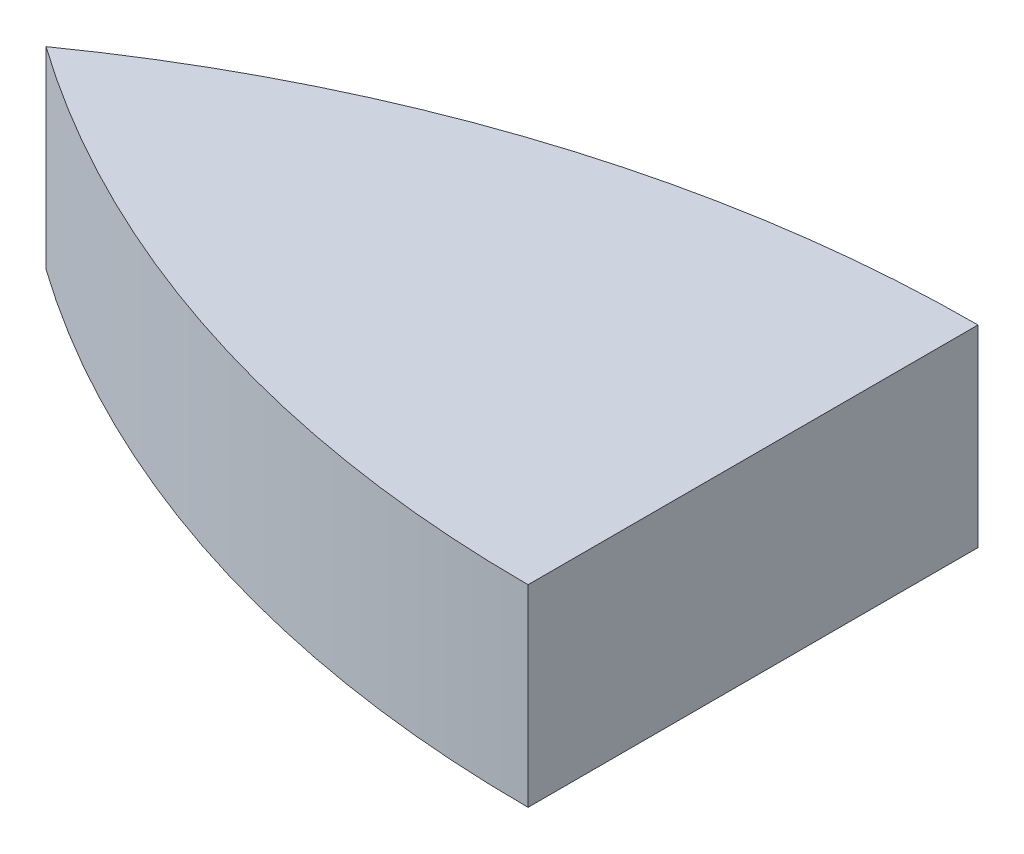
ISO-10303-21;
HEADER;
FILE_DESCRIPTION(('STEP AP214'),'2;1');
FILE_NAME('part.step','',(''),(''),'','','');
FILE_SCHEMA(('AUTOMOTIVE_DESIGN { 1 0 10303 214 1 1 1 1 }'));
ENDSEC;
DATA;
#1=APPLICATION_CONTEXT('core data for automotive mechanical design processes');
#2=APPLICATION_PROTOCOL_DEFINITION('international standard','automotive_design',2000,#1);
#3=PRODUCT_CONTEXT('',#1,'mechanical');
#4=PRODUCT('Part','Part','',(#3));
#5=PRODUCT_RELATED_PRODUCT_CATEGORY('part','',(#4));
#6=PRODUCT_DEFINITION_FORMATION('','',#4);
#7=PRODUCT_DEFINITION_CONTEXT('part definition',#1,'design');
#8=PRODUCT_DEFINITION('design','',#6,#7);
#9=PRODUCT_DEFINITION_SHAPE('','',#8);
#10=(LENGTH_UNIT() NAMED_UNIT(*) SI_UNIT(.MILLI.,.METRE.));
#11=(NAMED_UNIT(*) PLANE_ANGLE_UNIT() SI_UNIT($,.RADIAN.));
#12=(NAMED_UNIT(*) SI_UNIT($,.STERADIAN.) SOLID_ANGLE_UNIT());
#13=UNCERTAINTY_MEASURE_WITH_UNIT(LENGTH_MEASURE(1.E-05),#10,'distance_accuracy_value','');
#14=(GEOMETRIC_REPRESENTATION_CONTEXT(3) GLOBAL_UNCERTAINTY_ASSIGNED_CONTEXT((#13)) GLOBAL_UNIT_ASSIGNED_CONTEXT((#10,
#11,#12)) REPRESENTATION_CONTEXT('',''));
#15=CARTESIAN_POINT('',(0.,0.,0.));
#16=DIRECTION('',(0.,0.,1.));
#17=DIRECTION('',(1.,0.,0.));
#18=AXIS2_PLACEMENT_3D('',#15,#16,#17);
#19=CARTESIAN_POINT('',(13.2614708861326,1.5,7.76785714285714));
#20=DIRECTION('',(0.,-1.,0.));
#21=DIRECTION('',(0.,0.,-1.));
#22=AXIS2_PLACEMENT_3D('',#19,#20,#21);
#23=CYLINDRICAL_SURFACE('',#22,9.51785714285714);
#24=CARTESIAN_POINT('',(13.2614708861326,0.,7.76785714285714));
#25=DIRECTION('',(0.,1.,0.));
#26=DIRECTION('',(0.,0.,1.));
#27=AXIS2_PLACEMENT_3D('',#24,#25,#26);
#28=CIRCLE('',#27,9.51785714285714);
#29=CARTESIAN_POINT('',(13.2614708861326,0.,-1.75));
#30=VERTEX_POINT('',#29);
#31=CARTESIAN_POINT('',(7.76147088613261,0.,0.));
#32=VERTEX_POINT('',#31);
#33=EDGE_CURVE('E93',#30,#32,#28,.T.);
#34=ORIENTED_EDGE('',*,*,#33,.T.);
#35=DIRECTION('',(0.,-1.,0.));
#36=VECTOR('',#35,1.);
#37=CARTESIAN_POINT('',(7.76147088613261,1.5,0.));
#38=LINE('',#37,#36);
#39=CARTESIAN_POINT('',(7.76147088613261,1.5,0.));
#40=VERTEX_POINT('',#39);
#41=EDGE_CURVE('E11',#40,#32,#38,.T.);
#42=ORIENTED_EDGE('',*,*,#41,.F.);
#43=CARTESIAN_POINT('',(13.2614708861326,1.5,7.76785714285714));
#44=DIRECTION('',(0.,1.,0.));
#45=DIRECTION('',(0.,0.,1.));
#46=AXIS2_PLACEMENT_3D('',#43,#44,#45);
#47=CIRCLE('',#46,9.51785714285714);
#48=CARTESIAN_POINT('',(13.2614708861326,1.5,-1.75));
#49=VERTEX_POINT('',#48);
#50=EDGE_CURVE('E85',#49,#40,#47,.T.);
#51=ORIENTED_EDGE('',*,*,#50,.F.);
#52=DIRECTION('',(0.,-1.,0.));
#53=VECTOR('',#52,1.);
#54=CARTESIAN_POINT('',(13.2614708861326,1.5,-1.75));
#55=LINE('',#54,#53);
#56=EDGE_CURVE('E94',#49,#30,#55,.T.);
#57=ORIENTED_EDGE('',*,*,#56,.T.);
#58=EDGE_LOOP('',(#34,#42,#51,#57));
#59=FACE_BOUND('',#58,.T.);
#60=ADVANCED_FACE('F43',(#59),#23,.T.);
#61=CARTESIAN_POINT('',(13.2614708861326,1.5,-7.76785714285714));
#62=DIRECTION('',(0.,-1.,0.));
#63=DIRECTION('',(0.,0.,-1.));
#64=AXIS2_PLACEMENT_3D('',#61,#62,#63);
#65=CYLINDRICAL_SURFACE('',#64,9.51785714285714);
#66=CARTESIAN_POINT('',(13.2614708861326,0.,-7.76785714285714));
#67=DIRECTION('',(0.,1.,0.));
#68=DIRECTION('',(0.,0.,-1.));
#69=AXIS2_PLACEMENT_3D('',#66,#67,#68);
#70=CIRCLE('',#69,9.51785714285714);
#71=CARTESIAN_POINT('',(13.2614708861326,0.,1.75));
#72=VERTEX_POINT('',#71);
#73=EDGE_CURVE('E72',#32,#72,#70,.T.);
#74=ORIENTED_EDGE('',*,*,#73,.T.);
#75=DIRECTION('',(0.,-1.,0.));
#76=VECTOR('',#75,1.);
#77=CARTESIAN_POINT('',(13.2614708861326,1.5,1.75));
#78=LINE('',#77,#76);
#79=CARTESIAN_POINT('',(13.2614708861326,1.5,1.75));
#80=VERTEX_POINT('',#79);
#81=EDGE_CURVE('E52',#80,#72,#78,.T.);
#82=ORIENTED_EDGE('',*,*,#81,.F.);
#83=CARTESIAN_POINT('',(13.2614708861326,1.5,-7.76785714285714));
#84=DIRECTION('',(0.,1.,0.));
#85=DIRECTION('',(0.,0.,-1.));
#86=AXIS2_PLACEMENT_3D('',#83,#84,#85);
#87=CIRCLE('',#86,9.51785714285714);
#88=EDGE_CURVE('E80',#40,#80,#87,.T.);
#89=ORIENTED_EDGE('',*,*,#88,.F.);
#90=ORIENTED_EDGE('',*,*,#41,.T.);
#91=EDGE_LOOP('',(#74,#82,#89,#90));
#92=FACE_BOUND('',#91,.T.);
#93=ADVANCED_FACE('F81',(#92),#65,.T.);
#94=CARTESIAN_POINT('',(13.2614708861326,1.5,-1.75));
#95=DIRECTION('',(-1.,0.,0.));
#96=DIRECTION('',(0.,0.,1.));
#97=AXIS2_PLACEMENT_3D('',#94,#95,#96);
#98=PLANE('',#97);
#99=DIRECTION('',(0.,0.,-1.));
#100=VECTOR('',#99,1.);
#101=CARTESIAN_POINT('',(13.2614708861326,0.,-1.75));
#102=LINE('',#101,#100);
#103=EDGE_CURVE('E77',#72,#30,#102,.T.);
#104=ORIENTED_EDGE('',*,*,#103,.T.);
#105=ORIENTED_EDGE('',*,*,#56,.F.);
#106=DIRECTION('',(0.,0.,-1.));
#107=VECTOR('',#106,1.);
#108=CARTESIAN_POINT('',(13.2614708861326,1.5,-1.75));
#109=LINE('',#108,#107);
#110=EDGE_CURVE('E60',#80,#49,#109,.T.);
#111=ORIENTED_EDGE('',*,*,#110,.F.);
#112=ORIENTED_EDGE('',*,*,#81,.T.);
#113=EDGE_LOOP('',(#104,#105,#111,#112));
#114=FACE_BOUND('',#113,.T.);
#115=ADVANCED_FACE('F106',(#114),#98,.F.);
#116=CARTESIAN_POINT('',(13.2614708861326,1.5,7.76785714285714));
#117=DIRECTION('',(0.,1.,0.));
#118=DIRECTION('',(0.,0.,1.));
#119=AXIS2_PLACEMENT_3D('',#116,#117,#118);
#120=PLANE('',#119);
#121=ORIENTED_EDGE('',*,*,#50,.T.);
#122=ORIENTED_EDGE('',*,*,#88,.T.);
#123=ORIENTED_EDGE('',*,*,#110,.T.);
#124=EDGE_LOOP('',(#121,#122,#123));
#125=FACE_BOUND('',#124,.T.);
#126=ADVANCED_FACE('F88',(#125),#120,.T.);
#127=CARTESIAN_POINT('',(13.2614708861326,0.,7.76785714285714));
#128=DIRECTION('',(0.,1.,0.));
#129=DIRECTION('',(0.,0.,1.));
#130=AXIS2_PLACEMENT_3D('',#127,#128,#129);
#131=PLANE('',#130);
#132=ORIENTED_EDGE('',*,*,#33,.F.);
#133=ORIENTED_EDGE('',*,*,#103,.F.);
#134=ORIENTED_EDGE('',*,*,#73,.F.);
#135=EDGE_LOOP('',(#132,#133,#134));
#136=FACE_BOUND('',#135,.T.);
#137=ADVANCED_FACE('F107',(#136),#131,.F.);
#138=CLOSED_SHELL('',(#60,#93,#115,#126,#137));
#139=MANIFOLD_SOLID_BREP('B2',#138);
#140=ADVANCED_BREP_SHAPE_REPRESENTATION('',(#18,#139),#14);
#141=SHAPE_DEFINITION_REPRESENTATION(#9,#140);
ENDSEC;
END-ISO-10303-21;
